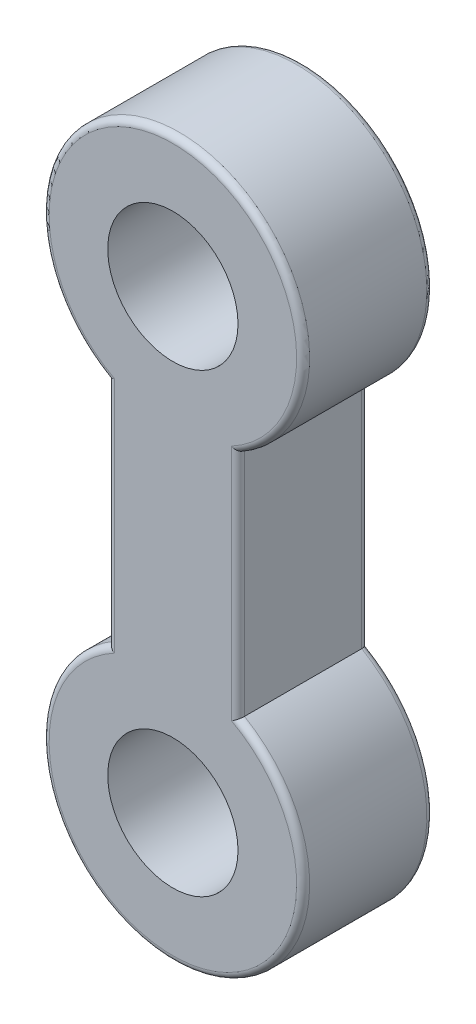
ISO-10303-21;
HEADER;
FILE_DESCRIPTION(('STEP AP214'),'2;1');
FILE_NAME('part.step','',(''),(''),'','','');
FILE_SCHEMA(('AUTOMOTIVE_DESIGN { 1 0 10303 214 1 1 1 1 }'));
ENDSEC;
DATA;
#1=APPLICATION_CONTEXT('core data for automotive mechanical design processes');
#2=APPLICATION_PROTOCOL_DEFINITION('international standard','automotive_design',2000,#1);
#3=PRODUCT_CONTEXT('',#1,'mechanical');
#4=PRODUCT('Part','Part','',(#3));
#5=PRODUCT_RELATED_PRODUCT_CATEGORY('part','',(#4));
#6=PRODUCT_DEFINITION_FORMATION('','',#4);
#7=PRODUCT_DEFINITION_CONTEXT('part definition',#1,'design');
#8=PRODUCT_DEFINITION('design','',#6,#7);
#9=PRODUCT_DEFINITION_SHAPE('','',#8);
#10=(LENGTH_UNIT() NAMED_UNIT(*) SI_UNIT(.MILLI.,.METRE.));
#11=(NAMED_UNIT(*) PLANE_ANGLE_UNIT() SI_UNIT($,.RADIAN.));
#12=(NAMED_UNIT(*) SI_UNIT($,.STERADIAN.) SOLID_ANGLE_UNIT());
#13=UNCERTAINTY_MEASURE_WITH_UNIT(LENGTH_MEASURE(1.E-05),#10,'distance_accuracy_value','');
#14=(GEOMETRIC_REPRESENTATION_CONTEXT(3) GLOBAL_UNCERTAINTY_ASSIGNED_CONTEXT((#13)) GLOBAL_UNIT_ASSIGNED_CONTEXT((#10,
#11,#12)) REPRESENTATION_CONTEXT('',''));
#15=CARTESIAN_POINT('',(0.,0.,0.));
#16=DIRECTION('',(0.,0.,1.));
#17=DIRECTION('',(1.,0.,0.));
#18=AXIS2_PLACEMENT_3D('',#15,#16,#17);
#19=CARTESIAN_POINT('',(0.,0.,20.));
#20=DIRECTION('',(0.,0.,1.));
#21=DIRECTION('',(1.,0.,0.));
#22=AXIS2_PLACEMENT_3D('',#19,#20,#21);
#23=PLANE('',#22);
#24=DIRECTION('',(0.,-1.,0.));
#25=VECTOR('',#24,1.);
#26=CARTESIAN_POINT('',(-9.,-52.6794919243112,20.));
#27=LINE('',#26,#25);
#28=CARTESIAN_POINT('',(-9.,-16.7332005306815,20.));
#29=VERTEX_POINT('',#28);
#30=CARTESIAN_POINT('',(-9.,-53.2667994693185,20.));
#31=VERTEX_POINT('',#30);
#32=EDGE_CURVE('E132',#29,#31,#27,.T.);
#33=ORIENTED_EDGE('',*,*,#32,.T.);
#34=CARTESIAN_POINT('',(0.,-70.,20.));
#35=DIRECTION('',(0.,0.,1.));
#36=DIRECTION('',(1.,0.,0.));
#37=AXIS2_PLACEMENT_3D('',#34,#35,#36);
#38=CIRCLE('',#37,19.);
#39=CARTESIAN_POINT('',(9.,-53.2667994693185,20.));
#40=VERTEX_POINT('',#39);
#41=EDGE_CURVE('E113',#31,#40,#38,.T.);
#42=ORIENTED_EDGE('',*,*,#41,.T.);
#43=DIRECTION('',(0.,1.,0.));
#44=VECTOR('',#43,1.);
#45=CARTESIAN_POINT('',(9.,-17.3205080756888,20.));
#46=LINE('',#45,#44);
#47=CARTESIAN_POINT('',(9.,-16.7332005306815,20.));
#48=VERTEX_POINT('',#47);
#49=EDGE_CURVE('E121',#40,#48,#46,.T.);
#50=ORIENTED_EDGE('',*,*,#49,.T.);
#51=CARTESIAN_POINT('',(0.,0.,20.));
#52=DIRECTION('',(0.,0.,1.));
#53=DIRECTION('',(1.,0.,0.));
#54=AXIS2_PLACEMENT_3D('',#51,#52,#53);
#55=CIRCLE('',#54,19.);
#56=EDGE_CURVE('E127',#48,#29,#55,.T.);
#57=ORIENTED_EDGE('',*,*,#56,.T.);
#58=EDGE_LOOP('',(#33,#42,#50,#57));
#59=FACE_BOUND('',#58,.T.);
#60=CARTESIAN_POINT('',(0.,0.,20.));
#61=DIRECTION('',(0.,0.,1.));
#62=DIRECTION('',(1.,0.,0.));
#63=AXIS2_PLACEMENT_3D('',#60,#61,#62);
#64=CIRCLE('',#63,10.);
#65=CARTESIAN_POINT('',(10.,0.,20.));
#66=VERTEX_POINT('',#65);
#67=EDGE_CURVE('E249',#66,#66,#64,.T.);
#68=ORIENTED_EDGE('',*,*,#67,.F.);
#69=EDGE_LOOP('',(#68));
#70=FACE_BOUND('',#69,.T.);
#71=CARTESIAN_POINT('',(0.,-70.,20.));
#72=DIRECTION('',(0.,0.,1.));
#73=DIRECTION('',(1.,0.,0.));
#74=AXIS2_PLACEMENT_3D('',#71,#72,#73);
#75=CIRCLE('',#74,10.);
#76=CARTESIAN_POINT('',(10.,-70.,20.));
#77=VERTEX_POINT('',#76);
#78=EDGE_CURVE('E299',#77,#77,#75,.T.);
#79=ORIENTED_EDGE('',*,*,#78,.F.);
#80=EDGE_LOOP('',(#79));
#81=FACE_BOUND('',#80,.T.);
#82=ADVANCED_FACE('F36',(#59,#70,#81),#23,.T.);
#83=CARTESIAN_POINT('',(0.,0.,0.));
#84=DIRECTION('',(0.,0.,1.));
#85=DIRECTION('',(1.,0.,0.));
#86=AXIS2_PLACEMENT_3D('',#83,#84,#85);
#87=PLANE('',#86);
#88=CARTESIAN_POINT('',(0.,0.,0.));
#89=DIRECTION('',(0.,0.,1.));
#90=DIRECTION('',(1.,0.,0.));
#91=AXIS2_PLACEMENT_3D('',#88,#89,#90);
#92=CIRCLE('',#91,19.);
#93=CARTESIAN_POINT('',(-9.,-16.7332005306815,0.));
#94=VERTEX_POINT('',#93);
#95=CARTESIAN_POINT('',(9.,-16.7332005306815,0.));
#96=VERTEX_POINT('',#95);
#97=EDGE_CURVE('E154',#94,#96,#92,.F.);
#98=ORIENTED_EDGE('',*,*,#97,.T.);
#99=DIRECTION('',(0.,1.,0.));
#100=VECTOR('',#99,1.);
#101=CARTESIAN_POINT('',(9.,0.,0.));
#102=LINE('',#101,#100);
#103=CARTESIAN_POINT('',(9.,-53.2667994693185,0.));
#104=VERTEX_POINT('',#103);
#105=EDGE_CURVE('E11',#96,#104,#102,.F.);
#106=ORIENTED_EDGE('',*,*,#105,.T.);
#107=CARTESIAN_POINT('',(0.,-70.,0.));
#108=DIRECTION('',(0.,0.,1.));
#109=DIRECTION('',(1.,0.,0.));
#110=AXIS2_PLACEMENT_3D('',#107,#108,#109);
#111=CIRCLE('',#110,19.);
#112=CARTESIAN_POINT('',(-9.,-53.2667994693185,0.));
#113=VERTEX_POINT('',#112);
#114=EDGE_CURVE('E50',#104,#113,#111,.F.);
#115=ORIENTED_EDGE('',*,*,#114,.T.);
#116=DIRECTION('',(0.,-1.,0.));
#117=VECTOR('',#116,1.);
#118=CARTESIAN_POINT('',(-9.,0.,0.));
#119=LINE('',#118,#117);
#120=EDGE_CURVE('E156',#113,#94,#119,.F.);
#121=ORIENTED_EDGE('',*,*,#120,.T.);
#122=EDGE_LOOP('',(#98,#106,#115,#121));
#123=FACE_BOUND('',#122,.T.);
#124=CARTESIAN_POINT('',(0.,0.,0.));
#125=DIRECTION('',(0.,0.,1.));
#126=DIRECTION('',(1.,0.,0.));
#127=AXIS2_PLACEMENT_3D('',#124,#125,#126);
#128=CIRCLE('',#127,10.);
#129=CARTESIAN_POINT('',(10.,0.,0.));
#130=VERTEX_POINT('',#129);
#131=EDGE_CURVE('E254',#130,#130,#128,.T.);
#132=ORIENTED_EDGE('',*,*,#131,.T.);
#133=EDGE_LOOP('',(#132));
#134=FACE_BOUND('',#133,.T.);
#135=CARTESIAN_POINT('',(0.,-70.,0.));
#136=DIRECTION('',(0.,0.,1.));
#137=DIRECTION('',(1.,0.,0.));
#138=AXIS2_PLACEMENT_3D('',#135,#136,#137);
#139=CIRCLE('',#138,10.);
#140=CARTESIAN_POINT('',(10.,-70.,0.));
#141=VERTEX_POINT('',#140);
#142=EDGE_CURVE('E193',#141,#141,#139,.T.);
#143=ORIENTED_EDGE('',*,*,#142,.T.);
#144=EDGE_LOOP('',(#143));
#145=FACE_BOUND('',#144,.T.);
#146=ADVANCED_FACE('F233',(#123,#134,#145),#87,.F.);
#147=CARTESIAN_POINT('',(0.,0.,20.));
#148=DIRECTION('',(0.,0.,-1.));
#149=DIRECTION('',(-1.,0.,0.));
#150=AXIS2_PLACEMENT_3D('',#147,#148,#149);
#151=CYLINDRICAL_SURFACE('',#150,20.);
#152=DIRECTION('',(0.,0.,-1.));
#153=VECTOR('',#152,1.);
#154=CARTESIAN_POINT('',(-10.,-17.3205080756888,20.));
#155=LINE('',#154,#153);
#156=CARTESIAN_POINT('',(-10.,-17.3205080756888,19.));
#157=VERTEX_POINT('',#156);
#158=CARTESIAN_POINT('',(-10.,-17.3205080756888,0.999999999999997));
#159=VERTEX_POINT('',#158);
#160=EDGE_CURVE('E128',#157,#159,#155,.T.);
#161=ORIENTED_EDGE('',*,*,#160,.F.);
#162=CARTESIAN_POINT('',(0.,0.,19.));
#163=DIRECTION('',(0.,0.,1.));
#164=DIRECTION('',(1.,0.,0.));
#165=AXIS2_PLACEMENT_3D('',#162,#163,#164);
#166=CIRCLE('',#165,20.);
#167=CARTESIAN_POINT('',(10.,-17.3205080756888,19.));
#168=VERTEX_POINT('',#167);
#169=EDGE_CURVE('E147',#157,#168,#166,.F.);
#170=ORIENTED_EDGE('',*,*,#169,.T.);
#171=DIRECTION('',(0.,0.,-1.));
#172=VECTOR('',#171,1.);
#173=CARTESIAN_POINT('',(10.,-17.3205080756888,20.));
#174=LINE('',#173,#172);
#175=CARTESIAN_POINT('',(10.,-17.3205080756888,0.999999999999997));
#176=VERTEX_POINT('',#175);
#177=EDGE_CURVE('E244',#168,#176,#174,.T.);
#178=ORIENTED_EDGE('',*,*,#177,.T.);
#179=CARTESIAN_POINT('',(0.,0.,1.));
#180=DIRECTION('',(0.,0.,1.));
#181=DIRECTION('',(1.,0.,0.));
#182=AXIS2_PLACEMENT_3D('',#179,#180,#181);
#183=CIRCLE('',#182,20.);
#184=EDGE_CURVE('E145',#176,#159,#183,.T.);
#185=ORIENTED_EDGE('',*,*,#184,.T.);
#186=EDGE_LOOP('',(#161,#170,#178,#185));
#187=FACE_BOUND('',#186,.T.);
#188=ADVANCED_FACE('F247',(#187),#151,.T.);
#189=CARTESIAN_POINT('',(-10.,-17.3205080756888,20.));
#190=DIRECTION('',(1.,0.,0.));
#191=DIRECTION('',(0.,0.,-1.));
#192=AXIS2_PLACEMENT_3D('',#189,#190,#191);
#193=PLANE('',#192);
#194=DIRECTION('',(0.,0.,-1.));
#195=VECTOR('',#194,1.);
#196=CARTESIAN_POINT('',(-10.,-52.6794919243112,20.));
#197=LINE('',#196,#195);
#198=CARTESIAN_POINT('',(-10.,-52.6794919243112,19.));
#199=VERTEX_POINT('',#198);
#200=CARTESIAN_POINT('',(-10.,-52.6794919243112,0.999999999999997));
#201=VERTEX_POINT('',#200);
#202=EDGE_CURVE('E251',#199,#201,#197,.T.);
#203=ORIENTED_EDGE('',*,*,#202,.F.);
#204=DIRECTION('',(0.,-1.,0.));
#205=VECTOR('',#204,1.);
#206=CARTESIAN_POINT('',(-10.,-17.3205080756888,19.));
#207=LINE('',#206,#205);
#208=EDGE_CURVE('E143',#199,#157,#207,.F.);
#209=ORIENTED_EDGE('',*,*,#208,.T.);
#210=ORIENTED_EDGE('',*,*,#160,.T.);
#211=DIRECTION('',(0.,-1.,0.));
#212=VECTOR('',#211,1.);
#213=CARTESIAN_POINT('',(-10.,-17.3205080756888,1.));
#214=LINE('',#213,#212);
#215=EDGE_CURVE('E141',#159,#201,#214,.T.);
#216=ORIENTED_EDGE('',*,*,#215,.T.);
#217=EDGE_LOOP('',(#203,#209,#210,#216));
#218=FACE_BOUND('',#217,.T.);
#219=ADVANCED_FACE('F267',(#218),#193,.F.);
#220=CARTESIAN_POINT('',(0.,-70.,20.));
#221=DIRECTION('',(0.,0.,-1.));
#222=DIRECTION('',(-1.,0.,0.));
#223=AXIS2_PLACEMENT_3D('',#220,#221,#222);
#224=CYLINDRICAL_SURFACE('',#223,20.);
#225=DIRECTION('',(0.,0.,-1.));
#226=VECTOR('',#225,1.);
#227=CARTESIAN_POINT('',(10.,-52.6794919243112,20.));
#228=LINE('',#227,#226);
#229=CARTESIAN_POINT('',(10.,-52.6794919243112,19.));
#230=VERTEX_POINT('',#229);
#231=CARTESIAN_POINT('',(10.,-52.6794919243112,0.999999999999997));
#232=VERTEX_POINT('',#231);
#233=EDGE_CURVE('E246',#230,#232,#228,.T.);
#234=ORIENTED_EDGE('',*,*,#233,.F.);
#235=CARTESIAN_POINT('',(0.,-70.,19.));
#236=DIRECTION('',(0.,0.,1.));
#237=DIRECTION('',(1.,0.,0.));
#238=AXIS2_PLACEMENT_3D('',#235,#236,#237);
#239=CIRCLE('',#238,20.);
#240=EDGE_CURVE('E115',#230,#199,#239,.F.);
#241=ORIENTED_EDGE('',*,*,#240,.T.);
#242=ORIENTED_EDGE('',*,*,#202,.T.);
#243=CARTESIAN_POINT('',(0.,-70.,1.));
#244=DIRECTION('',(0.,0.,1.));
#245=DIRECTION('',(1.,0.,0.));
#246=AXIS2_PLACEMENT_3D('',#243,#244,#245);
#247=CIRCLE('',#246,20.);
#248=EDGE_CURVE('E134',#201,#232,#247,.T.);
#249=ORIENTED_EDGE('',*,*,#248,.T.);
#250=EDGE_LOOP('',(#234,#241,#242,#249));
#251=FACE_BOUND('',#250,.T.);
#252=ADVANCED_FACE('F266',(#251),#224,.T.);
#253=CARTESIAN_POINT('',(10.,-17.3205080756888,20.));
#254=DIRECTION('',(-1.,0.,0.));
#255=DIRECTION('',(0.,0.,1.));
#256=AXIS2_PLACEMENT_3D('',#253,#254,#255);
#257=PLANE('',#256);
#258=ORIENTED_EDGE('',*,*,#177,.F.);
#259=DIRECTION('',(0.,1.,0.));
#260=VECTOR('',#259,1.);
#261=CARTESIAN_POINT('',(10.,-52.6794919243112,19.));
#262=LINE('',#261,#260);
#263=EDGE_CURVE('E152',#168,#230,#262,.F.);
#264=ORIENTED_EDGE('',*,*,#263,.T.);
#265=ORIENTED_EDGE('',*,*,#233,.T.);
#266=DIRECTION('',(0.,1.,0.));
#267=VECTOR('',#266,1.);
#268=CARTESIAN_POINT('',(10.,-17.3205080756888,1.));
#269=LINE('',#268,#267);
#270=EDGE_CURVE('E149',#232,#176,#269,.T.);
#271=ORIENTED_EDGE('',*,*,#270,.T.);
#272=EDGE_LOOP('',(#258,#264,#265,#271));
#273=FACE_BOUND('',#272,.T.);
#274=ADVANCED_FACE('F243',(#273),#257,.F.);
#275=CARTESIAN_POINT('',(0.,0.,20.));
#276=DIRECTION('',(0.,0.,-1.));
#277=DIRECTION('',(-1.,0.,0.));
#278=AXIS2_PLACEMENT_3D('',#275,#276,#277);
#279=CYLINDRICAL_SURFACE('',#278,10.);
#280=ORIENTED_EDGE('',*,*,#67,.T.);
#281=EDGE_LOOP('',(#280));
#282=FACE_BOUND('',#281,.T.);
#283=ORIENTED_EDGE('',*,*,#131,.F.);
#284=EDGE_LOOP('',(#283));
#285=FACE_BOUND('',#284,.T.);
#286=ADVANCED_FACE('F282',(#282,#285),#279,.F.);
#287=CARTESIAN_POINT('',(0.,-70.,20.));
#288=DIRECTION('',(0.,0.,-1.));
#289=DIRECTION('',(-1.,0.,0.));
#290=AXIS2_PLACEMENT_3D('',#287,#288,#289);
#291=CYLINDRICAL_SURFACE('',#290,10.);
#292=ORIENTED_EDGE('',*,*,#78,.T.);
#293=EDGE_LOOP('',(#292));
#294=FACE_BOUND('',#293,.T.);
#295=ORIENTED_EDGE('',*,*,#142,.F.);
#296=EDGE_LOOP('',(#295));
#297=FACE_BOUND('',#296,.T.);
#298=ADVANCED_FACE('F289',(#294,#297),#291,.F.);
#299=CARTESIAN_POINT('',(0.,0.,19.));
#300=DIRECTION('',(0.,0.,1.));
#301=DIRECTION('',(1.,0.,0.));
#302=AXIS2_PLACEMENT_3D('',#299,#300,#301);
#303=TOROIDAL_SURFACE('',#302,19.,1.);
#304=CARTESIAN_POINT('',(10.,-17.3205080756888,19.));
#305=CARTESIAN_POINT('',(10.0000015213787,-17.3205088649879,19.0254213694073));
#306=CARTESIAN_POINT('',(9.9990298908973,-17.3199479917732,19.0508294576426));
#307=CARTESIAN_POINT('',(9.99516504436778,-17.3177164417791,19.1014418799058));
#308=CARTESIAN_POINT('',(9.99227245124936,-17.3160461247702,19.1266462773057));
#309=CARTESIAN_POINT('',(9.98078809503932,-17.3094131179025,19.2014605330454));
#310=CARTESIAN_POINT('',(9.96938918157886,-17.3028280552472,19.2505313542434));
#311=CARTESIAN_POINT('',(9.93967240320598,-17.2856449291653,19.3456933166742));
#312=CARTESIAN_POINT('',(9.92136026994311,-17.2750501900846,19.391786889327));
#313=CARTESIAN_POINT('',(9.87861920031722,-17.2502909209951,19.480035288383));
#314=CARTESIAN_POINT('',(9.85418534373633,-17.2361235194671,19.5221869089135));
#315=CARTESIAN_POINT('',(9.79876970962982,-17.2039433022038,19.6037551827543));
#316=CARTESIAN_POINT('',(9.76751932861995,-17.1857722779364,19.6429258012997));
#317=CARTESIAN_POINT('',(9.70039220690246,-17.1466680871438,19.7154687382402));
#318=CARTESIAN_POINT('',(9.66451432931181,-17.1257342418196,19.7488396270128));
#319=CARTESIAN_POINT('',(9.58435755500454,-17.0788689993086,19.8133244345145));
#320=CARTESIAN_POINT('',(9.53959033522715,-17.0526405245776,19.8436145075656));
#321=CARTESIAN_POINT('',(9.44673922114586,-16.9981037001412,19.8962573307227));
#322=CARTESIAN_POINT('',(9.39865179544903,-16.9697931337577,19.9186014692109));
#323=CARTESIAN_POINT('',(9.2939250511975,-16.9079737334143,19.9576672613025));
#324=CARTESIAN_POINT('',(9.23698803401073,-16.8742683233141,19.9732764258468));
#325=CARTESIAN_POINT('',(9.12192232680775,-16.8059397288755,19.9942558815965));
#326=CARTESIAN_POINT('',(9.0637963634934,-16.7713186005823,19.999647414163));
#327=CARTESIAN_POINT('',(9.00385664538732,-16.7355051991757,19.9999944308194));
#328=CARTESIAN_POINT('',(9.00192824516759,-16.7343528787191,20.0000000085153));
#329=CARTESIAN_POINT('',(9.,-16.7332005306815,20.));
#330=B_SPLINE_CURVE_WITH_KNOTS('',3,(#304,#305,#306,#307,#308,#309,#310,#311,#312,#313,#314,
#315,#316,#317,#318,#319,#320,#321,#322,#323,#324,#325,#326,#327,#328,#329),.UNSPECIFIED.,.F.,
.F.,(4,2,2,2,2,2,2,2,2,2,2,2,4),(0.,0.0762135177415197,0.1524023330285,0.304010944443037,
0.455494134438775,0.607099468929364,0.766370013796125,0.925679763039859,1.10520657890246,
1.28492737298502,1.48807392731624,1.69079769648834,1.69753705604942),.UNSPECIFIED.);
#331=EDGE_CURVE('E124',#168,#48,#330,.T.);
#332=ORIENTED_EDGE('',*,*,#331,.F.);
#333=ORIENTED_EDGE('',*,*,#169,.F.);
#334=CARTESIAN_POINT('',(-10.,-17.3205080756888,19.));
#335=CARTESIAN_POINT('',(-10.0000015213787,-17.3205088649879,19.0254213694073));
#336=CARTESIAN_POINT('',(-9.9990298908973,-17.3199479917732,19.0508294576426));
#337=CARTESIAN_POINT('',(-9.99516504436778,-17.3177164417791,19.1014418799058));
#338=CARTESIAN_POINT('',(-9.99227245124936,-17.3160461247702,19.1266462773057));
#339=CARTESIAN_POINT('',(-9.98078809503932,-17.3094131179025,19.2014605330454));
#340=CARTESIAN_POINT('',(-9.96938918157886,-17.3028280552472,19.2505313542434));
#341=CARTESIAN_POINT('',(-9.93967240320598,-17.2856449291653,19.3456933166742));
#342=CARTESIAN_POINT('',(-9.92136026994311,-17.2750501900846,19.391786889327));
#343=CARTESIAN_POINT('',(-9.87861920031722,-17.2502909209951,19.480035288383));
#344=CARTESIAN_POINT('',(-9.85418534373633,-17.2361235194671,19.5221869089135));
#345=CARTESIAN_POINT('',(-9.79876970962982,-17.2039433022038,19.6037551827543));
#346=CARTESIAN_POINT('',(-9.76751932861995,-17.1857722779364,19.6429258012997));
#347=CARTESIAN_POINT('',(-9.70039220690246,-17.1466680871438,19.7154687382402));
#348=CARTESIAN_POINT('',(-9.66451432931181,-17.1257342418196,19.7488396270128));
#349=CARTESIAN_POINT('',(-9.58435755500454,-17.0788689993086,19.8133244345145));
#350=CARTESIAN_POINT('',(-9.53959033522715,-17.0526405245776,19.8436145075656));
#351=CARTESIAN_POINT('',(-9.44673922114586,-16.9981037001412,19.8962573307227));
#352=CARTESIAN_POINT('',(-9.39865179544903,-16.9697931337577,19.9186014692109));
#353=CARTESIAN_POINT('',(-9.2939250511975,-16.9079737334143,19.9576672613025));
#354=CARTESIAN_POINT('',(-9.23698803401073,-16.8742683233141,19.9732764258468));
#355=CARTESIAN_POINT('',(-9.12192232680775,-16.8059397288755,19.9942558815965));
#356=CARTESIAN_POINT('',(-9.0637963634934,-16.7713186005823,19.999647414163));
#357=CARTESIAN_POINT('',(-9.00385664538732,-16.7355051991757,19.9999944308194));
#358=CARTESIAN_POINT('',(-9.00192824516759,-16.7343528787191,20.0000000085153));
#359=CARTESIAN_POINT('',(-9.,-16.7332005306815,20.));
#360=B_SPLINE_CURVE_WITH_KNOTS('',3,(#334,#335,#336,#337,#338,#339,#340,#341,#342,#343,#344,
#345,#346,#347,#348,#349,#350,#351,#352,#353,#354,#355,#356,#357,#358,#359),.UNSPECIFIED.,.F.,
.F.,(4,2,2,2,2,2,2,2,2,2,2,2,4),(0.,0.0762135177415197,0.1524023330285,0.304010944443037,
0.455494134438775,0.607099468929364,0.766370013796125,0.925679763039859,1.10520657890246,
1.28492737298502,1.48807392731624,1.69079769648834,1.69753705604942),.UNSPECIFIED.);
#361=EDGE_CURVE('E186',#29,#157,#360,.F.);
#362=ORIENTED_EDGE('',*,*,#361,.F.);
#363=ORIENTED_EDGE('',*,*,#56,.F.);
#364=EDGE_LOOP('',(#332,#333,#362,#363));
#365=FACE_BOUND('',#364,.T.);
#366=ADVANCED_FACE('F180',(#365),#303,.T.);
#367=CARTESIAN_POINT('',(-9.,0.,19.));
#368=DIRECTION('',(0.,1.,0.));
#369=DIRECTION('',(0.,0.,1.));
#370=AXIS2_PLACEMENT_3D('',#367,#368,#369);
#371=CYLINDRICAL_SURFACE('',#370,1.);
#372=ORIENTED_EDGE('',*,*,#361,.T.);
#373=ORIENTED_EDGE('',*,*,#208,.F.);
#374=CARTESIAN_POINT('',(-10.,-52.6794919243112,19.));
#375=CARTESIAN_POINT('',(-10.0000015213787,-52.6794911350121,19.0254213694073));
#376=CARTESIAN_POINT('',(-9.9990298908973,-52.6800520082268,19.0508294576426));
#377=CARTESIAN_POINT('',(-9.99516504436778,-52.6822835582209,19.1014418799058));
#378=CARTESIAN_POINT('',(-9.99227245124936,-52.6839538752299,19.1266462773057));
#379=CARTESIAN_POINT('',(-9.98078809503932,-52.6905868820975,19.2014605330454));
#380=CARTESIAN_POINT('',(-9.96938918157886,-52.6971719447528,19.2505313542434));
#381=CARTESIAN_POINT('',(-9.93967240320598,-52.7143550708347,19.3456933166742));
#382=CARTESIAN_POINT('',(-9.92136026994311,-52.7249498099154,19.391786889327));
#383=CARTESIAN_POINT('',(-9.87861920031722,-52.7497090790049,19.480035288383));
#384=CARTESIAN_POINT('',(-9.85418534373633,-52.7638764805329,19.5221869089135));
#385=CARTESIAN_POINT('',(-9.79876970962983,-52.7960566977962,19.6037551827543));
#386=CARTESIAN_POINT('',(-9.76751932861995,-52.8142277220636,19.6429258012997));
#387=CARTESIAN_POINT('',(-9.70039220690246,-52.8533319128562,19.7154687382402));
#388=CARTESIAN_POINT('',(-9.66451432931181,-52.8742657581804,19.7488396270128));
#389=CARTESIAN_POINT('',(-9.58435755500454,-52.9211310006914,19.8133244345145));
#390=CARTESIAN_POINT('',(-9.53959033522715,-52.9473594754224,19.8436145075656));
#391=CARTESIAN_POINT('',(-9.44673922114585,-53.0018962998588,19.8962573307227));
#392=CARTESIAN_POINT('',(-9.39865179544902,-53.0302068662423,19.9186014692109));
#393=CARTESIAN_POINT('',(-9.29392505119751,-53.0920262665857,19.9576672613025));
#394=CARTESIAN_POINT('',(-9.23698803401076,-53.125731676686,19.9732764258468));
#395=CARTESIAN_POINT('',(-9.12192232680771,-53.1940602711244,19.9942558815965));
#396=CARTESIAN_POINT('',(-9.06379636349326,-53.2286813994175,19.999647414163));
#397=CARTESIAN_POINT('',(-9.00385664538731,-53.2644948008243,19.9999944308194));
#398=CARTESIAN_POINT('',(-9.00192824516759,-53.2656471212808,20.0000000085153));
#399=CARTESIAN_POINT('',(-9.,-53.2667994693185,20.));
#400=B_SPLINE_CURVE_WITH_KNOTS('',3,(#374,#375,#376,#377,#378,#379,#380,#381,#382,#383,#384,
#385,#386,#387,#388,#389,#390,#391,#392,#393,#394,#395,#396,#397,#398,#399),.UNSPECIFIED.,.F.,
.F.,(4,2,2,2,2,2,2,2,2,2,2,2,4),(0.,0.0762135177415232,0.152402333028501,0.304010944443036,
0.455494134438772,0.607099468929363,0.766370013796124,0.92567976303986,1.10520657890246,
1.28492737298502,1.48807392731625,1.69079769648834,1.69753705604942),.UNSPECIFIED.);
#401=EDGE_CURVE('E118',#31,#199,#400,.F.);
#402=ORIENTED_EDGE('',*,*,#401,.F.);
#403=ORIENTED_EDGE('',*,*,#32,.F.);
#404=EDGE_LOOP('',(#372,#373,#402,#403));
#405=FACE_BOUND('',#404,.T.);
#406=ADVANCED_FACE('F175',(#405),#371,.T.);
#407=CARTESIAN_POINT('',(9.,0.,19.));
#408=DIRECTION('',(0.,-1.,0.));
#409=DIRECTION('',(0.,0.,-1.));
#410=AXIS2_PLACEMENT_3D('',#407,#408,#409);
#411=CYLINDRICAL_SURFACE('',#410,1.);
#412=ORIENTED_EDGE('',*,*,#331,.T.);
#413=ORIENTED_EDGE('',*,*,#49,.F.);
#414=CARTESIAN_POINT('',(10.,-52.6794919243112,19.));
#415=CARTESIAN_POINT('',(10.0000015213787,-52.6794911350121,19.0254213694073));
#416=CARTESIAN_POINT('',(9.9990298908973,-52.6800520082268,19.0508294576426));
#417=CARTESIAN_POINT('',(9.99516504436778,-52.6822835582209,19.1014418799058));
#418=CARTESIAN_POINT('',(9.99227245124936,-52.6839538752298,19.1266462773057));
#419=CARTESIAN_POINT('',(9.98078809503932,-52.6905868820975,19.2014605330454));
#420=CARTESIAN_POINT('',(9.96938918157886,-52.6971719447528,19.2505313542434));
#421=CARTESIAN_POINT('',(9.93967240320598,-52.7143550708347,19.3456933166742));
#422=CARTESIAN_POINT('',(9.92136026994311,-52.7249498099154,19.391786889327));
#423=CARTESIAN_POINT('',(9.87861920031722,-52.7497090790049,19.480035288383));
#424=CARTESIAN_POINT('',(9.85418534373633,-52.7638764805329,19.5221869089135));
#425=CARTESIAN_POINT('',(9.79876970962982,-52.7960566977962,19.6037551827543));
#426=CARTESIAN_POINT('',(9.76751932861995,-52.8142277220636,19.6429258012997));
#427=CARTESIAN_POINT('',(9.70039220690246,-52.8533319128561,19.7154687382402));
#428=CARTESIAN_POINT('',(9.66451432931181,-52.8742657581804,19.7488396270128));
#429=CARTESIAN_POINT('',(9.58435755500453,-52.9211310006914,19.8133244345145));
#430=CARTESIAN_POINT('',(9.53959033522714,-52.9473594754224,19.8436145075656));
#431=CARTESIAN_POINT('',(9.44673922114586,-53.0018962998588,19.8962573307227));
#432=CARTESIAN_POINT('',(9.39865179544904,-53.0302068662423,19.9186014692109));
#433=CARTESIAN_POINT('',(9.29392505119749,-53.0920262665857,19.9576672613025));
#434=CARTESIAN_POINT('',(9.23698803401067,-53.1257316766858,19.9732764258468));
#435=CARTESIAN_POINT('',(9.1219223268078,-53.1940602711246,19.9942558815965));
#436=CARTESIAN_POINT('',(9.06379636349359,-53.2286813994181,19.999647414163));
#437=CARTESIAN_POINT('',(9.00385664538733,-53.2644948008243,19.9999944308194));
#438=CARTESIAN_POINT('',(9.0019282451676,-53.2656471212809,20.0000000085153));
#439=CARTESIAN_POINT('',(9.,-53.2667994693185,20.));
#440=B_SPLINE_CURVE_WITH_KNOTS('',3,(#414,#415,#416,#417,#418,#419,#420,#421,#422,#423,#424,
#425,#426,#427,#428,#429,#430,#431,#432,#433,#434,#435,#436,#437,#438,#439),.UNSPECIFIED.,.F.,
.F.,(4,2,2,2,2,2,2,2,2,2,2,2,4),(0.,0.0762135177415198,0.152402333028501,0.304010944443037,
0.455494134438774,0.607099468929365,0.766370013796124,0.925679763039859,1.10520657890246,
1.28492737298502,1.48807392731625,1.69079769648835,1.69753705604942),.UNSPECIFIED.);
#441=EDGE_CURVE('E109',#230,#40,#440,.T.);
#442=ORIENTED_EDGE('',*,*,#441,.F.);
#443=ORIENTED_EDGE('',*,*,#263,.F.);
#444=EDGE_LOOP('',(#412,#413,#442,#443));
#445=FACE_BOUND('',#444,.T.);
#446=ADVANCED_FACE('F122',(#445),#411,.T.);
#447=CARTESIAN_POINT('',(0.,-70.,19.));
#448=DIRECTION('',(0.,0.,1.));
#449=DIRECTION('',(1.,0.,0.));
#450=AXIS2_PLACEMENT_3D('',#447,#448,#449);
#451=TOROIDAL_SURFACE('',#450,19.,1.);
#452=ORIENTED_EDGE('',*,*,#401,.T.);
#453=ORIENTED_EDGE('',*,*,#240,.F.);
#454=ORIENTED_EDGE('',*,*,#441,.T.);
#455=ORIENTED_EDGE('',*,*,#41,.F.);
#456=EDGE_LOOP('',(#452,#453,#454,#455));
#457=FACE_BOUND('',#456,.T.);
#458=ADVANCED_FACE('F111',(#457),#451,.T.);
#459=CARTESIAN_POINT('',(-9.,-17.3205080756888,1.));
#460=DIRECTION('',(0.,-1.,0.));
#461=DIRECTION('',(0.,0.,-1.));
#462=AXIS2_PLACEMENT_3D('',#459,#460,#461);
#463=CYLINDRICAL_SURFACE('',#462,1.);
#464=CARTESIAN_POINT('',(-10.,-17.3205080756888,0.999999999999997));
#465=CARTESIAN_POINT('',(-10.0000015213787,-17.3205088649879,0.974578630592668));
#466=CARTESIAN_POINT('',(-9.9990298908973,-17.3199479917732,0.949170542357406));
#467=CARTESIAN_POINT('',(-9.99516504436778,-17.3177164417791,0.898558120094177));
#468=CARTESIAN_POINT('',(-9.99227245124936,-17.3160461247702,0.873353722694295));
#469=CARTESIAN_POINT('',(-9.98078809503932,-17.3094131179025,0.798539466954644));
#470=CARTESIAN_POINT('',(-9.96938918157886,-17.3028280552472,0.749468645756606));
#471=CARTESIAN_POINT('',(-9.93967240320598,-17.2856449291653,0.654306683325831));
#472=CARTESIAN_POINT('',(-9.92136026994311,-17.2750501900846,0.60821311067301));
#473=CARTESIAN_POINT('',(-9.87861920031722,-17.2502909209951,0.519964711616969));
#474=CARTESIAN_POINT('',(-9.85418534373633,-17.2361235194671,0.477813091086526));
#475=CARTESIAN_POINT('',(-9.79876970962982,-17.2039433022038,0.396244817245725));
#476=CARTESIAN_POINT('',(-9.76751932861995,-17.1857722779364,0.357074198700322));
#477=CARTESIAN_POINT('',(-9.70039220690246,-17.1466680871438,0.284531261759824));
#478=CARTESIAN_POINT('',(-9.66451432931181,-17.1257342418196,0.251160372987181));
#479=CARTESIAN_POINT('',(-9.58435755500453,-17.0788689993086,0.186675565485451));
#480=CARTESIAN_POINT('',(-9.53959033522714,-17.0526405245776,0.156385492434425));
#481=CARTESIAN_POINT('',(-9.44673922114585,-16.9981037001412,0.103742669277255));
#482=CARTESIAN_POINT('',(-9.39865179544902,-16.9697931337577,0.0813985307891208));
#483=CARTESIAN_POINT('',(-9.29392505119751,-16.9079737334143,0.0423327386974859));
#484=CARTESIAN_POINT('',(-9.23698803401077,-16.874268323314,0.0267235741532199));
#485=CARTESIAN_POINT('',(-9.1219223268077,-16.8059397288756,0.00574411840347044));
#486=CARTESIAN_POINT('',(-9.06379636349322,-16.7713186005826,0.000352585836995661));
#487=CARTESIAN_POINT('',(-9.00385664538731,-16.7355051991757,5.5691805878335E-06));
#488=CARTESIAN_POINT('',(-9.00192824516759,-16.7343528787192,-8.51534436458942E-09));
#489=CARTESIAN_POINT('',(-9.,-16.7332005306815,0.));
#490=B_SPLINE_CURVE_WITH_KNOTS('',3,(#464,#465,#466,#467,#468,#469,#470,#471,#472,#473,#474,
#475,#476,#477,#478,#479,#480,#481,#482,#483,#484,#485,#486,#487,#488,#489),.UNSPECIFIED.,.F.,
.F.,(4,2,2,2,2,2,2,2,2,2,2,2,4),(0.,0.0762135177415196,0.152402333028498,0.304010944443037,
0.455494134438774,0.607099468929366,0.766370013796126,0.925679763039861,1.10520657890246,
1.28492737298502,1.48807392731625,1.69079769648834,1.69753705604942),.UNSPECIFIED.);
#491=EDGE_CURVE('E218',#94,#159,#490,.F.);
#492=ORIENTED_EDGE('',*,*,#491,.F.);
#493=ORIENTED_EDGE('',*,*,#120,.F.);
#494=CARTESIAN_POINT('',(-10.,-52.6794919243112,0.999999999999997));
#495=CARTESIAN_POINT('',(-10.0000015213787,-52.6794911350121,0.974578630592668));
#496=CARTESIAN_POINT('',(-9.9990298908973,-52.6800520082268,0.949170542357406));
#497=CARTESIAN_POINT('',(-9.99516504436778,-52.6822835582209,0.898558120094177));
#498=CARTESIAN_POINT('',(-9.99227245124936,-52.6839538752298,0.873353722694295));
#499=CARTESIAN_POINT('',(-9.98078809503932,-52.6905868820975,0.798539466954643));
#500=CARTESIAN_POINT('',(-9.96938918157886,-52.6971719447528,0.749468645756606));
#501=CARTESIAN_POINT('',(-9.93967240320598,-52.7143550708347,0.65430668332583));
#502=CARTESIAN_POINT('',(-9.92136026994311,-52.7249498099154,0.60821311067301));
#503=CARTESIAN_POINT('',(-9.87861920031722,-52.7497090790049,0.519964711616968));
#504=CARTESIAN_POINT('',(-9.85418534373633,-52.7638764805329,0.477813091086525));
#505=CARTESIAN_POINT('',(-9.79876970962983,-52.7960566977962,0.396244817245725));
#506=CARTESIAN_POINT('',(-9.76751932861995,-52.8142277220636,0.357074198700322));
#507=CARTESIAN_POINT('',(-9.70039220690246,-52.8533319128562,0.284531261759825));
#508=CARTESIAN_POINT('',(-9.66451432931181,-52.8742657581804,0.251160372987181));
#509=CARTESIAN_POINT('',(-9.58435755500454,-52.9211310006914,0.186675565485453));
#510=CARTESIAN_POINT('',(-9.53959033522715,-52.9473594754224,0.156385492434428));
#511=CARTESIAN_POINT('',(-9.44673922114586,-53.0018962998588,0.103742669277256));
#512=CARTESIAN_POINT('',(-9.39865179544902,-53.0302068662423,0.0813985307891219));
#513=CARTESIAN_POINT('',(-9.29392505119751,-53.0920262665857,0.042332738697487));
#514=CARTESIAN_POINT('',(-9.23698803401076,-53.125731676686,0.026723574153221));
#515=CARTESIAN_POINT('',(-9.12192232680772,-53.1940602711244,0.00574411840347089));
#516=CARTESIAN_POINT('',(-9.06379636349327,-53.2286813994175,0.000352585836996313));
#517=CARTESIAN_POINT('',(-9.00385664538731,-53.2644948008243,5.56918058787681E-06));
#518=CARTESIAN_POINT('',(-9.00192824516759,-53.2656471212808,-8.51534434175625E-09));
#519=CARTESIAN_POINT('',(-9.,-53.2667994693185,0.));
#520=B_SPLINE_CURVE_WITH_KNOTS('',3,(#494,#495,#496,#497,#498,#499,#500,#501,#502,#503,#504,
#505,#506,#507,#508,#509,#510,#511,#512,#513,#514,#515,#516,#517,#518,#519),.UNSPECIFIED.,.F.,
.F.,(4,2,2,2,2,2,2,2,2,2,2,2,4),(0.,0.0762135177415195,0.152402333028498,0.304010944443037,
0.455494134438777,0.607099468929366,0.766370013796123,0.925679763039861,1.10520657890246,
1.28492737298502,1.48807392731624,1.69079769648834,1.69753705604942),.UNSPECIFIED.);
#521=EDGE_CURVE('E41',#201,#113,#520,.T.);
#522=ORIENTED_EDGE('',*,*,#521,.F.);
#523=ORIENTED_EDGE('',*,*,#215,.F.);
#524=EDGE_LOOP('',(#492,#493,#522,#523));
#525=FACE_BOUND('',#524,.T.);
#526=ADVANCED_FACE('F38',(#525),#463,.T.);
#527=CARTESIAN_POINT('',(0.,-70.,1.));
#528=DIRECTION('',(0.,0.,1.));
#529=DIRECTION('',(1.,0.,0.));
#530=AXIS2_PLACEMENT_3D('',#527,#528,#529);
#531=TOROIDAL_SURFACE('',#530,19.,1.);
#532=ORIENTED_EDGE('',*,*,#521,.T.);
#533=ORIENTED_EDGE('',*,*,#114,.F.);
#534=CARTESIAN_POINT('',(10.,-52.6794919243112,0.999999999999997));
#535=CARTESIAN_POINT('',(10.0000015213787,-52.6794911350121,0.974578630592668));
#536=CARTESIAN_POINT('',(9.9990298908973,-52.6800520082268,0.949170542357406));
#537=CARTESIAN_POINT('',(9.99516504436778,-52.6822835582209,0.898558120094177));
#538=CARTESIAN_POINT('',(9.99227245124936,-52.6839538752298,0.873353722694294));
#539=CARTESIAN_POINT('',(9.98078809503932,-52.6905868820975,0.798539466954643));
#540=CARTESIAN_POINT('',(9.96938918157886,-52.6971719447528,0.749468645756606));
#541=CARTESIAN_POINT('',(9.93967240320598,-52.7143550708347,0.654306683325831));
#542=CARTESIAN_POINT('',(9.92136026994311,-52.7249498099154,0.60821311067301));
#543=CARTESIAN_POINT('',(9.87861920031722,-52.7497090790049,0.519964711616969));
#544=CARTESIAN_POINT('',(9.85418534373633,-52.7638764805329,0.477813091086526));
#545=CARTESIAN_POINT('',(9.79876970962982,-52.7960566977962,0.396244817245726));
#546=CARTESIAN_POINT('',(9.76751932861995,-52.8142277220636,0.357074198700323));
#547=CARTESIAN_POINT('',(9.70039220690246,-52.8533319128561,0.284531261759825));
#548=CARTESIAN_POINT('',(9.66451432931181,-52.8742657581804,0.251160372987182));
#549=CARTESIAN_POINT('',(9.58435755500453,-52.9211310006914,0.186675565485452));
#550=CARTESIAN_POINT('',(9.53959033522714,-52.9473594754224,0.156385492434426));
#551=CARTESIAN_POINT('',(9.44673922114586,-53.0018962998588,0.103742669277256));
#552=CARTESIAN_POINT('',(9.39865179544903,-53.0302068662423,0.0813985307891218));
#553=CARTESIAN_POINT('',(9.2939250511975,-53.0920262665857,0.0423327386974862));
#554=CARTESIAN_POINT('',(9.23698803401072,-53.1257316766859,0.0267235741532192));
#555=CARTESIAN_POINT('',(9.12192232680776,-53.1940602711245,0.00574411840347111));
#556=CARTESIAN_POINT('',(9.06379636349343,-53.2286813994178,0.000352585836998825));
#557=CARTESIAN_POINT('',(9.00385664538732,-53.2644948008243,5.56918058804659E-06));
#558=CARTESIAN_POINT('',(9.00192824516759,-53.2656471212808,-8.51534425251337E-09));
#559=CARTESIAN_POINT('',(9.,-53.2667994693185,0.));
#560=B_SPLINE_CURVE_WITH_KNOTS('',3,(#534,#535,#536,#537,#538,#539,#540,#541,#542,#543,#544,
#545,#546,#547,#548,#549,#550,#551,#552,#553,#554,#555,#556,#557,#558,#559),.UNSPECIFIED.,.F.,
.F.,(4,2,2,2,2,2,2,2,2,2,2,2,4),(0.,0.07621351774152,0.152402333028499,0.304010944443036,
0.455494134438774,0.607099468929366,0.766370013796125,0.925679763039859,1.10520657890246,
1.28492737298502,1.48807392731625,1.69079769648834,1.69753705604942),.UNSPECIFIED.);
#561=EDGE_CURVE('E58',#232,#104,#560,.T.);
#562=ORIENTED_EDGE('',*,*,#561,.F.);
#563=ORIENTED_EDGE('',*,*,#248,.F.);
#564=EDGE_LOOP('',(#532,#533,#562,#563));
#565=FACE_BOUND('',#564,.T.);
#566=ADVANCED_FACE('F214',(#565),#531,.T.);
#567=CARTESIAN_POINT('',(0.,0.,1.));
#568=DIRECTION('',(0.,0.,1.));
#569=DIRECTION('',(1.,0.,0.));
#570=AXIS2_PLACEMENT_3D('',#567,#568,#569);
#571=TOROIDAL_SURFACE('',#570,19.,1.);
#572=ORIENTED_EDGE('',*,*,#491,.T.);
#573=ORIENTED_EDGE('',*,*,#184,.F.);
#574=CARTESIAN_POINT('',(10.,-17.3205080756888,0.999999999999997));
#575=CARTESIAN_POINT('',(10.0000015213787,-17.3205088649879,0.974578630592668));
#576=CARTESIAN_POINT('',(9.9990298908973,-17.3199479917732,0.949170542357406));
#577=CARTESIAN_POINT('',(9.99516504436778,-17.3177164417791,0.898558120094177));
#578=CARTESIAN_POINT('',(9.99227245124936,-17.3160461247702,0.873353722694295));
#579=CARTESIAN_POINT('',(9.98078809503932,-17.3094131179025,0.798539466954644));
#580=CARTESIAN_POINT('',(9.96938918157886,-17.3028280552472,0.749468645756606));
#581=CARTESIAN_POINT('',(9.93967240320598,-17.2856449291653,0.654306683325831));
#582=CARTESIAN_POINT('',(9.92136026994311,-17.2750501900846,0.60821311067301));
#583=CARTESIAN_POINT('',(9.87861920031722,-17.2502909209951,0.519964711616969));
#584=CARTESIAN_POINT('',(9.85418534373633,-17.2361235194671,0.477813091086526));
#585=CARTESIAN_POINT('',(9.79876970962982,-17.2039433022038,0.396244817245725));
#586=CARTESIAN_POINT('',(9.76751932861995,-17.1857722779364,0.357074198700322));
#587=CARTESIAN_POINT('',(9.70039220690246,-17.1466680871438,0.284531261759824));
#588=CARTESIAN_POINT('',(9.66451432931181,-17.1257342418196,0.251160372987181));
#589=CARTESIAN_POINT('',(9.58435755500453,-17.0788689993086,0.186675565485451));
#590=CARTESIAN_POINT('',(9.53959033522714,-17.0526405245776,0.156385492434425));
#591=CARTESIAN_POINT('',(9.44673922114585,-16.9981037001412,0.103742669277255));
#592=CARTESIAN_POINT('',(9.39865179544902,-16.9697931337577,0.0813985307891208));
#593=CARTESIAN_POINT('',(9.29392505119751,-16.9079737334143,0.0423327386974859));
#594=CARTESIAN_POINT('',(9.23698803401077,-16.874268323314,0.0267235741532199));
#595=CARTESIAN_POINT('',(9.1219223268077,-16.8059397288756,0.00574411840347044));
#596=CARTESIAN_POINT('',(9.06379636349322,-16.7713186005826,0.000352585836995661));
#597=CARTESIAN_POINT('',(9.00385664538731,-16.7355051991757,5.5691805878335E-06));
#598=CARTESIAN_POINT('',(9.00192824516759,-16.7343528787192,-8.51534436458942E-09));
#599=CARTESIAN_POINT('',(9.,-16.7332005306815,0.));
#600=B_SPLINE_CURVE_WITH_KNOTS('',3,(#574,#575,#576,#577,#578,#579,#580,#581,#582,#583,#584,
#585,#586,#587,#588,#589,#590,#591,#592,#593,#594,#595,#596,#597,#598,#599),.UNSPECIFIED.,.F.,
.F.,(4,2,2,2,2,2,2,2,2,2,2,2,4),(0.,0.0762135177415196,0.152402333028498,0.304010944443037,
0.455494134438774,0.607099468929366,0.766370013796126,0.925679763039861,1.10520657890246,
1.28492737298502,1.48807392731625,1.69079769648834,1.69753705604942),.UNSPECIFIED.);
#601=EDGE_CURVE('E198',#96,#176,#600,.F.);
#602=ORIENTED_EDGE('',*,*,#601,.F.);
#603=ORIENTED_EDGE('',*,*,#97,.F.);
#604=EDGE_LOOP('',(#572,#573,#602,#603));
#605=FACE_BOUND('',#604,.T.);
#606=ADVANCED_FACE('F211',(#605),#571,.T.);
#607=CARTESIAN_POINT('',(9.,-17.3205080756888,1.));
#608=DIRECTION('',(0.,1.,0.));
#609=DIRECTION('',(0.,0.,1.));
#610=AXIS2_PLACEMENT_3D('',#607,#608,#609);
#611=CYLINDRICAL_SURFACE('',#610,1.);
#612=ORIENTED_EDGE('',*,*,#561,.T.);
#613=ORIENTED_EDGE('',*,*,#105,.F.);
#614=ORIENTED_EDGE('',*,*,#601,.T.);
#615=ORIENTED_EDGE('',*,*,#270,.F.);
#616=EDGE_LOOP('',(#612,#613,#614,#615));
#617=FACE_BOUND('',#616,.T.);
#618=ADVANCED_FACE('F209',(#617),#611,.T.);
#619=CLOSED_SHELL('',(#82,#146,#188,#219,#252,#274,#286,#298,#366,#406,#446,#458,#526,#566,#606,#618));
#620=MANIFOLD_SOLID_BREP('B2',#619);
#621=ADVANCED_BREP_SHAPE_REPRESENTATION('',(#18,#620),#14);
#622=SHAPE_DEFINITION_REPRESENTATION(#9,#621);
ENDSEC;
END-ISO-10303-21;
